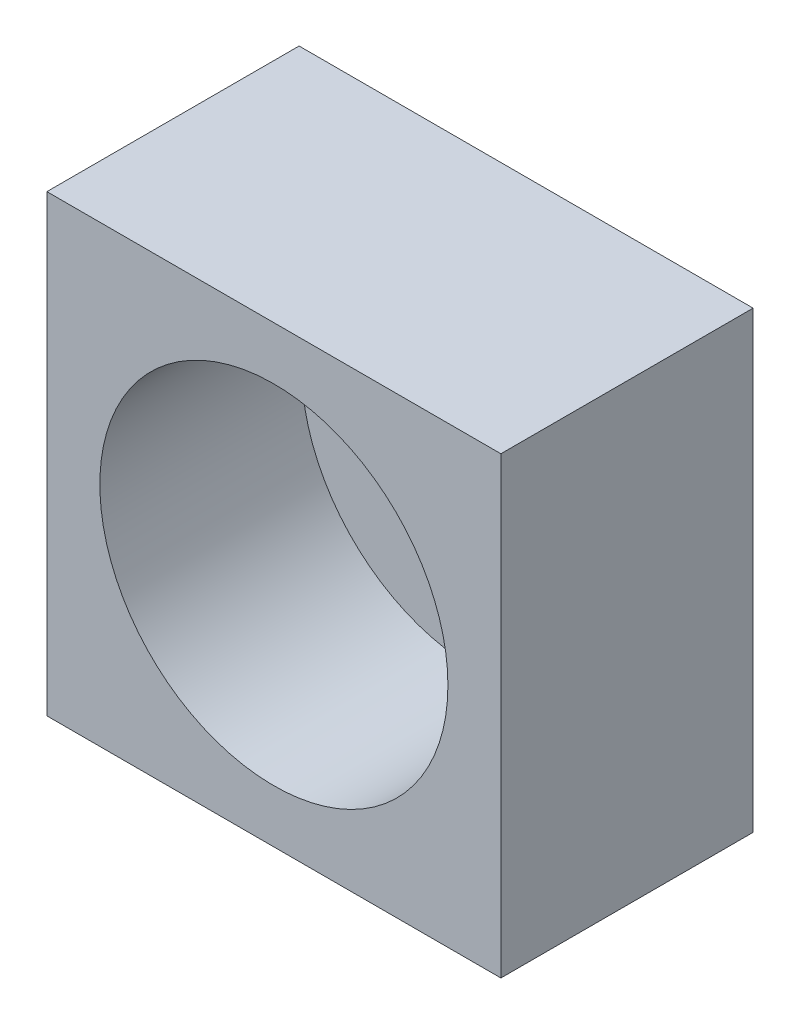
ISO-10303-21;
HEADER;
FILE_DESCRIPTION(('STEP AP214'),'2;1');
FILE_NAME('part.step','',(''),(''),'','','');
FILE_SCHEMA(('AUTOMOTIVE_DESIGN { 1 0 10303 214 1 1 1 1 }'));
ENDSEC;
DATA;
#1=APPLICATION_CONTEXT('core data for automotive mechanical design processes');
#2=APPLICATION_PROTOCOL_DEFINITION('international standard','automotive_design',2000,#1);
#3=PRODUCT_CONTEXT('',#1,'mechanical');
#4=PRODUCT('Part','Part','',(#3));
#5=PRODUCT_RELATED_PRODUCT_CATEGORY('part','',(#4));
#6=PRODUCT_DEFINITION_FORMATION('','',#4);
#7=PRODUCT_DEFINITION_CONTEXT('part definition',#1,'design');
#8=PRODUCT_DEFINITION('design','',#6,#7);
#9=PRODUCT_DEFINITION_SHAPE('','',#8);
#10=(LENGTH_UNIT() NAMED_UNIT(*) SI_UNIT(.MILLI.,.METRE.));
#11=(NAMED_UNIT(*) PLANE_ANGLE_UNIT() SI_UNIT($,.RADIAN.));
#12=(NAMED_UNIT(*) SI_UNIT($,.STERADIAN.) SOLID_ANGLE_UNIT());
#13=UNCERTAINTY_MEASURE_WITH_UNIT(LENGTH_MEASURE(1.E-05),#10,'distance_accuracy_value','');
#14=(GEOMETRIC_REPRESENTATION_CONTEXT(3) GLOBAL_UNCERTAINTY_ASSIGNED_CONTEXT((#13)) GLOBAL_UNIT_ASSIGNED_CONTEXT((#10,
#11,#12)) REPRESENTATION_CONTEXT('',''));
#15=CARTESIAN_POINT('',(0.,0.,0.));
#16=DIRECTION('',(0.,0.,1.));
#17=DIRECTION('',(1.,0.,0.));
#18=AXIS2_PLACEMENT_3D('',#15,#16,#17);
#19=CARTESIAN_POINT('',(9.,-9.,10.));
#20=DIRECTION('',(-1.,0.,0.));
#21=DIRECTION('',(0.,0.,1.));
#22=AXIS2_PLACEMENT_3D('',#19,#20,#21);
#23=PLANE('',#22);
#24=DIRECTION('',(0.,1.,0.));
#25=VECTOR('',#24,1.);
#26=CARTESIAN_POINT('',(9.,-9.,0.));
#27=LINE('',#26,#25);
#28=CARTESIAN_POINT('',(9.,-9.,0.));
#29=VERTEX_POINT('',#28);
#30=CARTESIAN_POINT('',(9.,9.,0.));
#31=VERTEX_POINT('',#30);
#32=EDGE_CURVE('E98',#29,#31,#27,.T.);
#33=ORIENTED_EDGE('',*,*,#32,.T.);
#34=DIRECTION('',(0.,0.,-1.));
#35=VECTOR('',#34,1.);
#36=CARTESIAN_POINT('',(9.,9.,10.));
#37=LINE('',#36,#35);
#38=CARTESIAN_POINT('',(9.,9.,10.));
#39=VERTEX_POINT('',#38);
#40=EDGE_CURVE('E11',#39,#31,#37,.T.);
#41=ORIENTED_EDGE('',*,*,#40,.F.);
#42=DIRECTION('',(0.,1.,0.));
#43=VECTOR('',#42,1.);
#44=CARTESIAN_POINT('',(9.,-9.,10.));
#45=LINE('',#44,#43);
#46=CARTESIAN_POINT('',(9.,-9.,10.));
#47=VERTEX_POINT('',#46);
#48=EDGE_CURVE('E85',#47,#39,#45,.T.);
#49=ORIENTED_EDGE('',*,*,#48,.F.);
#50=DIRECTION('',(0.,0.,-1.));
#51=VECTOR('',#50,1.);
#52=CARTESIAN_POINT('',(9.,-9.,10.));
#53=LINE('',#52,#51);
#54=EDGE_CURVE('E94',#47,#29,#53,.T.);
#55=ORIENTED_EDGE('',*,*,#54,.T.);
#56=EDGE_LOOP('',(#33,#41,#49,#55));
#57=FACE_BOUND('',#56,.T.);
#58=ADVANCED_FACE('F33',(#57),#23,.F.);
#59=CARTESIAN_POINT('',(-9.,9.,10.));
#60=DIRECTION('',(0.,-1.,0.));
#61=DIRECTION('',(0.,0.,-1.));
#62=AXIS2_PLACEMENT_3D('',#59,#60,#61);
#63=PLANE('',#62);
#64=DIRECTION('',(-1.,0.,0.));
#65=VECTOR('',#64,1.);
#66=CARTESIAN_POINT('',(-9.,9.,0.));
#67=LINE('',#66,#65);
#68=CARTESIAN_POINT('',(-9.,9.,0.));
#69=VERTEX_POINT('',#68);
#70=EDGE_CURVE('E89',#31,#69,#67,.T.);
#71=ORIENTED_EDGE('',*,*,#70,.T.);
#72=DIRECTION('',(0.,0.,-1.));
#73=VECTOR('',#72,1.);
#74=CARTESIAN_POINT('',(-9.,9.,10.));
#75=LINE('',#74,#73);
#76=CARTESIAN_POINT('',(-9.,9.,10.));
#77=VERTEX_POINT('',#76);
#78=EDGE_CURVE('E42',#77,#69,#75,.T.);
#79=ORIENTED_EDGE('',*,*,#78,.F.);
#80=DIRECTION('',(-1.,0.,0.));
#81=VECTOR('',#80,1.);
#82=CARTESIAN_POINT('',(-9.,9.,10.));
#83=LINE('',#82,#81);
#84=EDGE_CURVE('E80',#39,#77,#83,.T.);
#85=ORIENTED_EDGE('',*,*,#84,.F.);
#86=ORIENTED_EDGE('',*,*,#40,.T.);
#87=EDGE_LOOP('',(#71,#79,#85,#86));
#88=FACE_BOUND('',#87,.T.);
#89=ADVANCED_FACE('F88',(#88),#63,.F.);
#90=CARTESIAN_POINT('',(-9.,-9.,10.));
#91=DIRECTION('',(1.,0.,0.));
#92=DIRECTION('',(0.,0.,-1.));
#93=AXIS2_PLACEMENT_3D('',#90,#91,#92);
#94=PLANE('',#93);
#95=DIRECTION('',(0.,-1.,0.));
#96=VECTOR('',#95,1.);
#97=CARTESIAN_POINT('',(-9.,-9.,0.));
#98=LINE('',#97,#96);
#99=CARTESIAN_POINT('',(-9.,-9.,0.));
#100=VERTEX_POINT('',#99);
#101=EDGE_CURVE('E67',#69,#100,#98,.T.);
#102=ORIENTED_EDGE('',*,*,#101,.T.);
#103=DIRECTION('',(0.,0.,-1.));
#104=VECTOR('',#103,1.);
#105=CARTESIAN_POINT('',(-9.,-9.,10.));
#106=LINE('',#105,#104);
#107=CARTESIAN_POINT('',(-9.,-9.,10.));
#108=VERTEX_POINT('',#107);
#109=EDGE_CURVE('E90',#108,#100,#106,.T.);
#110=ORIENTED_EDGE('',*,*,#109,.F.);
#111=DIRECTION('',(0.,-1.,0.));
#112=VECTOR('',#111,1.);
#113=CARTESIAN_POINT('',(-9.,-9.,10.));
#114=LINE('',#113,#112);
#115=EDGE_CURVE('E83',#77,#108,#114,.T.);
#116=ORIENTED_EDGE('',*,*,#115,.F.);
#117=ORIENTED_EDGE('',*,*,#78,.T.);
#118=EDGE_LOOP('',(#102,#110,#116,#117));
#119=FACE_BOUND('',#118,.T.);
#120=ADVANCED_FACE('F92',(#119),#94,.F.);
#121=CARTESIAN_POINT('',(-9.,-9.,10.));
#122=DIRECTION('',(0.,1.,0.));
#123=DIRECTION('',(0.,0.,1.));
#124=AXIS2_PLACEMENT_3D('',#121,#122,#123);
#125=PLANE('',#124);
#126=DIRECTION('',(1.,0.,0.));
#127=VECTOR('',#126,1.);
#128=CARTESIAN_POINT('',(-9.,-9.,0.));
#129=LINE('',#128,#127);
#130=EDGE_CURVE('E73',#100,#29,#129,.T.);
#131=ORIENTED_EDGE('',*,*,#130,.T.);
#132=ORIENTED_EDGE('',*,*,#54,.F.);
#133=DIRECTION('',(1.,0.,0.));
#134=VECTOR('',#133,1.);
#135=CARTESIAN_POINT('',(-9.,-9.,10.));
#136=LINE('',#135,#134);
#137=EDGE_CURVE('E50',#108,#47,#136,.T.);
#138=ORIENTED_EDGE('',*,*,#137,.F.);
#139=ORIENTED_EDGE('',*,*,#109,.T.);
#140=EDGE_LOOP('',(#131,#132,#138,#139));
#141=FACE_BOUND('',#140,.T.);
#142=ADVANCED_FACE('F106',(#141),#125,.F.);
#143=CARTESIAN_POINT('',(0.,0.,10.));
#144=DIRECTION('',(0.,0.,-1.));
#145=DIRECTION('',(-1.,0.,0.));
#146=AXIS2_PLACEMENT_3D('',#143,#144,#145);
#147=PLANE('',#146);
#148=CARTESIAN_POINT('',(0.,0.,10.));
#149=DIRECTION('',(0.,0.,1.));
#150=DIRECTION('',(1.,0.,0.));
#151=AXIS2_PLACEMENT_3D('',#148,#149,#150);
#152=CIRCLE('',#151,6.9);
#153=CARTESIAN_POINT('',(6.9,0.,10.));
#154=VERTEX_POINT('',#153);
#155=EDGE_CURVE('E112',#154,#154,#152,.T.);
#156=ORIENTED_EDGE('',*,*,#155,.F.);
#157=EDGE_LOOP('',(#156));
#158=FACE_BOUND('',#157,.T.);
#159=ORIENTED_EDGE('',*,*,#48,.T.);
#160=ORIENTED_EDGE('',*,*,#84,.T.);
#161=ORIENTED_EDGE('',*,*,#115,.T.);
#162=ORIENTED_EDGE('',*,*,#137,.T.);
#163=EDGE_LOOP('',(#159,#160,#161,#162));
#164=FACE_BOUND('',#163,.T.);
#165=ADVANCED_FACE('F81',(#158,#164),#147,.F.);
#166=CARTESIAN_POINT('',(0.,0.,0.));
#167=DIRECTION('',(0.,0.,-1.));
#168=DIRECTION('',(-1.,0.,0.));
#169=AXIS2_PLACEMENT_3D('',#166,#167,#168);
#170=PLANE('',#169);
#171=CARTESIAN_POINT('',(0.,0.,0.));
#172=DIRECTION('',(0.,0.,-1.));
#173=DIRECTION('',(-1.,0.,0.));
#174=AXIS2_PLACEMENT_3D('',#171,#172,#173);
#175=CIRCLE('',#174,2.75);
#176=CARTESIAN_POINT('',(-2.75,0.,0.));
#177=VERTEX_POINT('',#176);
#178=EDGE_CURVE('E36',#177,#177,#175,.T.);
#179=ORIENTED_EDGE('',*,*,#178,.F.);
#180=EDGE_LOOP('',(#179));
#181=FACE_BOUND('',#180,.T.);
#182=ORIENTED_EDGE('',*,*,#32,.F.);
#183=ORIENTED_EDGE('',*,*,#130,.F.);
#184=ORIENTED_EDGE('',*,*,#101,.F.);
#185=ORIENTED_EDGE('',*,*,#70,.F.);
#186=EDGE_LOOP('',(#182,#183,#184,#185));
#187=FACE_BOUND('',#186,.T.);
#188=ADVANCED_FACE('F109',(#181,#187),#170,.T.);
#189=CARTESIAN_POINT('',(0.,0.,2.));
#190=DIRECTION('',(0.,0.,1.));
#191=DIRECTION('',(1.,0.,0.));
#192=AXIS2_PLACEMENT_3D('',#189,#190,#191);
#193=CYLINDRICAL_SURFACE('',#192,6.9);
#194=CARTESIAN_POINT('',(0.,0.,2.));
#195=DIRECTION('',(0.,0.,1.));
#196=DIRECTION('',(1.,0.,0.));
#197=AXIS2_PLACEMENT_3D('',#194,#195,#196);
#198=CIRCLE('',#197,6.9);
#199=CARTESIAN_POINT('',(6.9,0.,2.));
#200=VERTEX_POINT('',#199);
#201=EDGE_CURVE('E101',#200,#200,#198,.T.);
#202=ORIENTED_EDGE('',*,*,#201,.F.);
#203=EDGE_LOOP('',(#202));
#204=FACE_BOUND('',#203,.T.);
#205=ORIENTED_EDGE('',*,*,#155,.T.);
#206=EDGE_LOOP('',(#205));
#207=FACE_BOUND('',#206,.T.);
#208=ADVANCED_FACE('F127',(#204,#207),#193,.F.);
#209=CARTESIAN_POINT('',(0.,0.,2.));
#210=DIRECTION('',(0.,0.,1.));
#211=DIRECTION('',(1.,0.,0.));
#212=AXIS2_PLACEMENT_3D('',#209,#210,#211);
#213=PLANE('',#212);
#214=CARTESIAN_POINT('',(0.,0.,2.));
#215=DIRECTION('',(0.,0.,1.));
#216=DIRECTION('',(1.,0.,0.));
#217=AXIS2_PLACEMENT_3D('',#214,#215,#216);
#218=CIRCLE('',#217,2.75);
#219=CARTESIAN_POINT('',(2.75,0.,2.));
#220=VERTEX_POINT('',#219);
#221=EDGE_CURVE('E117',#220,#220,#218,.T.);
#222=ORIENTED_EDGE('',*,*,#221,.F.);
#223=EDGE_LOOP('',(#222));
#224=FACE_BOUND('',#223,.T.);
#225=ORIENTED_EDGE('',*,*,#201,.T.);
#226=EDGE_LOOP('',(#225));
#227=FACE_BOUND('',#226,.T.);
#228=ADVANCED_FACE('F133',(#224,#227),#213,.T.);
#229=CARTESIAN_POINT('',(0.,0.,-6.));
#230=DIRECTION('',(0.,0.,1.));
#231=DIRECTION('',(1.,0.,0.));
#232=AXIS2_PLACEMENT_3D('',#229,#230,#231);
#233=CYLINDRICAL_SURFACE('',#232,2.75);
#234=ORIENTED_EDGE('',*,*,#178,.T.);
#235=EDGE_LOOP('',(#234));
#236=FACE_BOUND('',#235,.T.);
#237=ORIENTED_EDGE('',*,*,#221,.T.);
#238=EDGE_LOOP('',(#237));
#239=FACE_BOUND('',#238,.T.);
#240=ADVANCED_FACE('F124',(#236,#239),#233,.F.);
#241=CLOSED_SHELL('',(#58,#89,#120,#142,#165,#188,#208,#228,#240));
#242=MANIFOLD_SOLID_BREP('B2',#241);
#243=ADVANCED_BREP_SHAPE_REPRESENTATION('',(#18,#242),#14);
#244=SHAPE_DEFINITION_REPRESENTATION(#9,#243);
ENDSEC;
END-ISO-10303-21;
